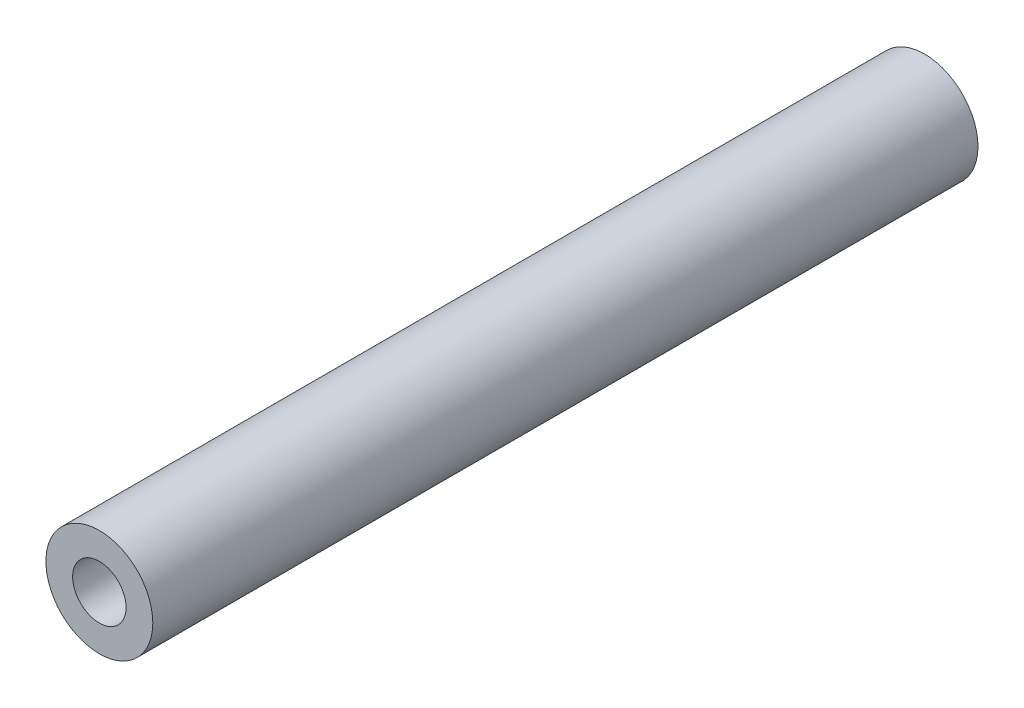
ISO-10303-21;
HEADER;
FILE_DESCRIPTION(('STEP AP214'),'2;1');
FILE_NAME('part.step','',(''),(''),'','','');
FILE_SCHEMA(('AUTOMOTIVE_DESIGN { 1 0 10303 214 1 1 1 1 }'));
ENDSEC;
DATA;
#1=APPLICATION_CONTEXT('core data for automotive mechanical design processes');
#2=APPLICATION_PROTOCOL_DEFINITION('international standard','automotive_design',2000,#1);
#3=PRODUCT_CONTEXT('',#1,'mechanical');
#4=PRODUCT('Part','Part','',(#3));
#5=PRODUCT_RELATED_PRODUCT_CATEGORY('part','',(#4));
#6=PRODUCT_DEFINITION_FORMATION('','',#4);
#7=PRODUCT_DEFINITION_CONTEXT('part definition',#1,'design');
#8=PRODUCT_DEFINITION('design','',#6,#7);
#9=PRODUCT_DEFINITION_SHAPE('','',#8);
#10=(LENGTH_UNIT() NAMED_UNIT(*) SI_UNIT(.MILLI.,.METRE.));
#11=(NAMED_UNIT(*) PLANE_ANGLE_UNIT() SI_UNIT($,.RADIAN.));
#12=(NAMED_UNIT(*) SI_UNIT($,.STERADIAN.) SOLID_ANGLE_UNIT());
#13=UNCERTAINTY_MEASURE_WITH_UNIT(LENGTH_MEASURE(1.E-05),#10,'distance_accuracy_value','');
#14=(GEOMETRIC_REPRESENTATION_CONTEXT(3) GLOBAL_UNCERTAINTY_ASSIGNED_CONTEXT((#13)) GLOBAL_UNIT_ASSIGNED_CONTEXT((#10,
#11,#12)) REPRESENTATION_CONTEXT('',''));
#15=CARTESIAN_POINT('',(0.,0.,0.));
#16=DIRECTION('',(0.,0.,1.));
#17=DIRECTION('',(1.,0.,0.));
#18=AXIS2_PLACEMENT_3D('',#15,#16,#17);
#19=CARTESIAN_POINT('',(0.,0.,19.3));
#20=DIRECTION('',(0.,0.,-1.));
#21=DIRECTION('',(-1.,0.,0.));
#22=AXIS2_PLACEMENT_3D('',#19,#20,#21);
#23=CYLINDRICAL_SURFACE('',#22,2.5);
#24=CARTESIAN_POINT('',(0.,0.,19.3));
#25=DIRECTION('',(0.,0.,1.));
#26=DIRECTION('',(1.,0.,0.));
#27=AXIS2_PLACEMENT_3D('',#24,#25,#26);
#28=CIRCLE('',#27,2.5);
#29=CARTESIAN_POINT('',(2.5,0.,19.3));
#30=VERTEX_POINT('',#29);
#31=EDGE_CURVE('E11',#30,#30,#28,.T.);
#32=ORIENTED_EDGE('',*,*,#31,.F.);
#33=EDGE_LOOP('',(#32));
#34=FACE_BOUND('',#33,.T.);
#35=CARTESIAN_POINT('',(0.,0.,-19.3));
#36=DIRECTION('',(0.,0.,1.));
#37=DIRECTION('',(1.,0.,0.));
#38=AXIS2_PLACEMENT_3D('',#35,#36,#37);
#39=CIRCLE('',#38,2.5);
#40=CARTESIAN_POINT('',(2.5,0.,-19.3));
#41=VERTEX_POINT('',#40);
#42=EDGE_CURVE('E41',#41,#41,#39,.T.);
#43=ORIENTED_EDGE('',*,*,#42,.T.);
#44=EDGE_LOOP('',(#43));
#45=FACE_BOUND('',#44,.T.);
#46=ADVANCED_FACE('F38',(#34,#45),#23,.T.);
#47=CARTESIAN_POINT('',(0.,0.,19.3));
#48=DIRECTION('',(0.,0.,1.));
#49=DIRECTION('',(1.,0.,0.));
#50=AXIS2_PLACEMENT_3D('',#47,#48,#49);
#51=PLANE('',#50);
#52=CARTESIAN_POINT('',(0.,0.,19.3));
#53=DIRECTION('',(0.,0.,1.));
#54=DIRECTION('',(1.,0.,0.));
#55=AXIS2_PLACEMENT_3D('',#52,#53,#54);
#56=CIRCLE('',#55,1.24999999999999);
#57=CARTESIAN_POINT('',(1.24999999999999,0.,19.3));
#58=VERTEX_POINT('',#57);
#59=EDGE_CURVE('E62',#58,#58,#56,.T.);
#60=ORIENTED_EDGE('',*,*,#59,.F.);
#61=EDGE_LOOP('',(#60));
#62=FACE_BOUND('',#61,.T.);
#63=ORIENTED_EDGE('',*,*,#31,.T.);
#64=EDGE_LOOP('',(#63));
#65=FACE_BOUND('',#64,.T.);
#66=ADVANCED_FACE('F80',(#62,#65),#51,.T.);
#67=CARTESIAN_POINT('',(0.,0.,-19.3));
#68=DIRECTION('',(0.,0.,1.));
#69=DIRECTION('',(1.,0.,0.));
#70=AXIS2_PLACEMENT_3D('',#67,#68,#69);
#71=PLANE('',#70);
#72=CARTESIAN_POINT('',(0.,0.,-19.3));
#73=DIRECTION('',(0.,0.,-1.));
#74=DIRECTION('',(-1.,0.,0.));
#75=AXIS2_PLACEMENT_3D('',#72,#73,#74);
#76=CIRCLE('',#75,1.24999999999999);
#77=CARTESIAN_POINT('',(-1.24999999999999,0.,-19.3));
#78=VERTEX_POINT('',#77);
#79=EDGE_CURVE('E61',#78,#78,#76,.T.);
#80=ORIENTED_EDGE('',*,*,#79,.F.);
#81=EDGE_LOOP('',(#80));
#82=FACE_BOUND('',#81,.T.);
#83=ORIENTED_EDGE('',*,*,#42,.F.);
#84=EDGE_LOOP('',(#83));
#85=FACE_BOUND('',#84,.T.);
#86=ADVANCED_FACE('F77',(#82,#85),#71,.F.);
#87=CARTESIAN_POINT('',(0.,0.,-10.8));
#88=DIRECTION('',(0.,0.,-1.));
#89=DIRECTION('',(-1.,0.,0.));
#90=AXIS2_PLACEMENT_3D('',#87,#88,#89);
#91=CONICAL_SURFACE('',#90,1.24999999999999,1.02974425867665);
#92=CARTESIAN_POINT('',(0.,0.,-10.0489242262156));
#93=VERTEX_POINT('',#92);
#94=VERTEX_LOOP('',#93);
#95=FACE_BOUND('',#94,.T.);
#96=CARTESIAN_POINT('',(0.,0.,-10.8));
#97=DIRECTION('',(0.,0.,-1.));
#98=DIRECTION('',(-1.,0.,0.));
#99=AXIS2_PLACEMENT_3D('',#96,#97,#98);
#100=CIRCLE('',#99,1.24999999999999);
#101=CARTESIAN_POINT('',(-1.24999999999999,0.,-10.8));
#102=VERTEX_POINT('',#101);
#103=EDGE_CURVE('E65',#102,#102,#100,.T.);
#104=ORIENTED_EDGE('',*,*,#103,.T.);
#105=EDGE_LOOP('',(#104));
#106=FACE_BOUND('',#105,.T.);
#107=ADVANCED_FACE('F79',(#95,#106),#91,.F.);
#108=CARTESIAN_POINT('',(0.,0.,-19.3));
#109=DIRECTION('',(0.,0.,-1.));
#110=DIRECTION('',(-1.,0.,0.));
#111=AXIS2_PLACEMENT_3D('',#108,#109,#110);
#112=CYLINDRICAL_SURFACE('',#111,1.24999999999999);
#113=ORIENTED_EDGE('',*,*,#103,.F.);
#114=EDGE_LOOP('',(#113));
#115=FACE_BOUND('',#114,.T.);
#116=ORIENTED_EDGE('',*,*,#79,.T.);
#117=EDGE_LOOP('',(#116));
#118=FACE_BOUND('',#117,.T.);
#119=ADVANCED_FACE('F55',(#115,#118),#112,.F.);
#120=CARTESIAN_POINT('',(0.,0.,10.8));
#121=DIRECTION('',(0.,0.,1.));
#122=DIRECTION('',(1.,0.,0.));
#123=AXIS2_PLACEMENT_3D('',#120,#121,#122);
#124=CONICAL_SURFACE('',#123,1.24999999999999,1.02974425867665);
#125=CARTESIAN_POINT('',(0.,0.,10.0489242262156));
#126=VERTEX_POINT('',#125);
#127=VERTEX_LOOP('',#126);
#128=FACE_BOUND('',#127,.T.);
#129=CARTESIAN_POINT('',(0.,0.,10.8));
#130=DIRECTION('',(0.,0.,1.));
#131=DIRECTION('',(1.,0.,0.));
#132=AXIS2_PLACEMENT_3D('',#129,#130,#131);
#133=CIRCLE('',#132,1.24999999999999);
#134=CARTESIAN_POINT('',(1.24999999999999,0.,10.8));
#135=VERTEX_POINT('',#134);
#136=EDGE_CURVE('E59',#135,#135,#133,.T.);
#137=ORIENTED_EDGE('',*,*,#136,.T.);
#138=EDGE_LOOP('',(#137));
#139=FACE_BOUND('',#138,.T.);
#140=ADVANCED_FACE('F51',(#128,#139),#124,.F.);
#141=CARTESIAN_POINT('',(0.,0.,19.3));
#142=DIRECTION('',(0.,0.,1.));
#143=DIRECTION('',(1.,0.,0.));
#144=AXIS2_PLACEMENT_3D('',#141,#142,#143);
#145=CYLINDRICAL_SURFACE('',#144,1.24999999999999);
#146=ORIENTED_EDGE('',*,*,#136,.F.);
#147=EDGE_LOOP('',(#146));
#148=FACE_BOUND('',#147,.T.);
#149=ORIENTED_EDGE('',*,*,#59,.T.);
#150=EDGE_LOOP('',(#149));
#151=FACE_BOUND('',#150,.T.);
#152=ADVANCED_FACE('F54',(#148,#151),#145,.F.);
#153=CLOSED_SHELL('',(#46,#66,#86,#107,#119,#140,#152));
#154=MANIFOLD_SOLID_BREP('B2',#153);
#155=ADVANCED_BREP_SHAPE_REPRESENTATION('',(#18,#154),#14);
#156=SHAPE_DEFINITION_REPRESENTATION(#9,#155);
ENDSEC;
END-ISO-10303-21;
